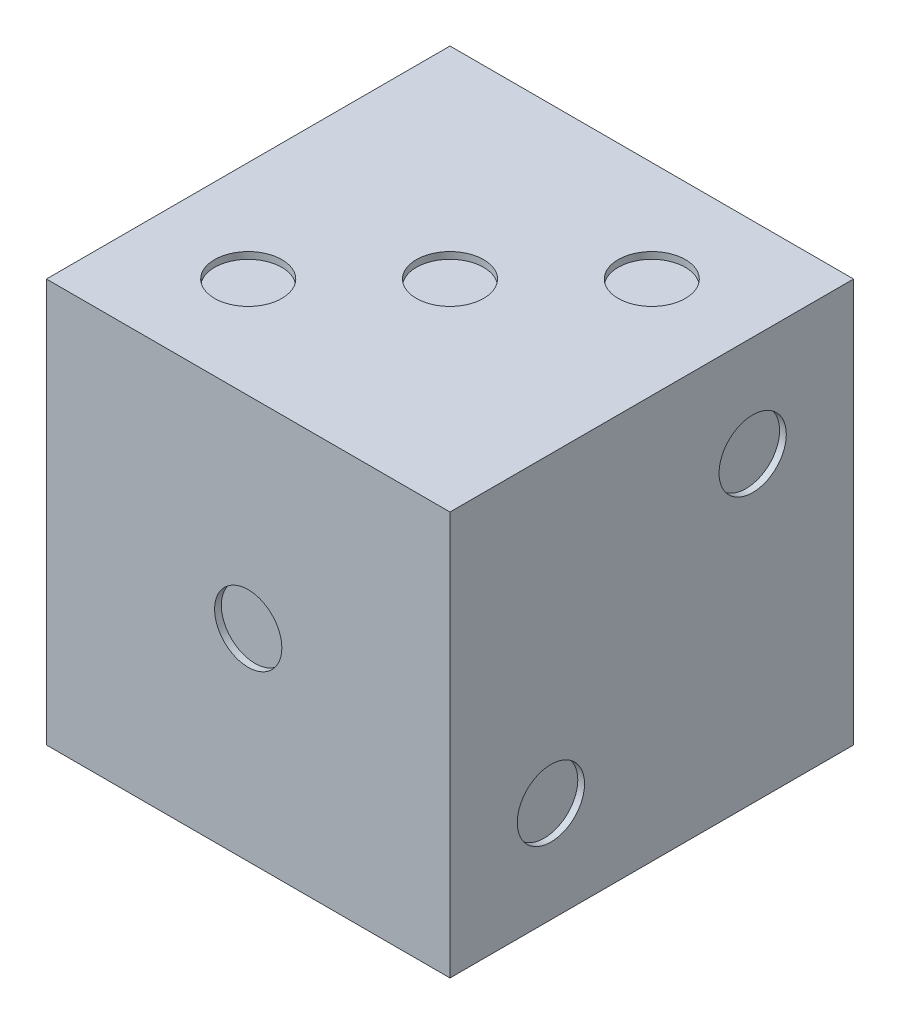
ISO-10303-21;
HEADER;
FILE_DESCRIPTION(('STEP AP214'),'2;1');
FILE_NAME('part.step','',(''),(''),'','','');
FILE_SCHEMA(('AUTOMOTIVE_DESIGN { 1 0 10303 214 1 1 1 1 }'));
ENDSEC;
DATA;
#1=APPLICATION_CONTEXT('core data for automotive mechanical design processes');
#2=APPLICATION_PROTOCOL_DEFINITION('international standard','automotive_design',2000,#1);
#3=PRODUCT_CONTEXT('',#1,'mechanical');
#4=PRODUCT('Part','Part','',(#3));
#5=PRODUCT_RELATED_PRODUCT_CATEGORY('part','',(#4));
#6=PRODUCT_DEFINITION_FORMATION('','',#4);
#7=PRODUCT_DEFINITION_CONTEXT('part definition',#1,'design');
#8=PRODUCT_DEFINITION('design','',#6,#7);
#9=PRODUCT_DEFINITION_SHAPE('','',#8);
#10=(LENGTH_UNIT() NAMED_UNIT(*) SI_UNIT(.MILLI.,.METRE.));
#11=(NAMED_UNIT(*) PLANE_ANGLE_UNIT() SI_UNIT($,.RADIAN.));
#12=(NAMED_UNIT(*) SI_UNIT($,.STERADIAN.) SOLID_ANGLE_UNIT());
#13=UNCERTAINTY_MEASURE_WITH_UNIT(LENGTH_MEASURE(1.E-05),#10,'distance_accuracy_value','');
#14=(GEOMETRIC_REPRESENTATION_CONTEXT(3) GLOBAL_UNCERTAINTY_ASSIGNED_CONTEXT((#13)) GLOBAL_UNIT_ASSIGNED_CONTEXT((#10,
#11,#12)) REPRESENTATION_CONTEXT('',''));
#15=CARTESIAN_POINT('',(0.,0.,0.));
#16=DIRECTION('',(0.,0.,1.));
#17=DIRECTION('',(1.,0.,0.));
#18=AXIS2_PLACEMENT_3D('',#15,#16,#17);
#19=CARTESIAN_POINT('',(0.,60.,0.));
#20=DIRECTION('',(1.,0.,0.));
#21=DIRECTION('',(0.,0.,-1.));
#22=AXIS2_PLACEMENT_3D('',#19,#20,#21);
#23=PLANE('',#22);
#24=CARTESIAN_POINT('',(0.,15.,-15.));
#25=DIRECTION('',(-1.,0.,0.));
#26=DIRECTION('',(0.,0.,1.));
#27=AXIS2_PLACEMENT_3D('',#24,#25,#26);
#28=CIRCLE('',#27,5.);
#29=CARTESIAN_POINT('',(0.,15.,-9.99999999999999));
#30=VERTEX_POINT('',#29);
#31=EDGE_CURVE('E133',#30,#30,#28,.T.);
#32=ORIENTED_EDGE('',*,*,#31,.F.);
#33=EDGE_LOOP('',(#32));
#34=FACE_BOUND('',#33,.T.);
#35=CARTESIAN_POINT('',(0.,15.,-45.));
#36=DIRECTION('',(-1.,0.,0.));
#37=DIRECTION('',(0.,0.,1.));
#38=AXIS2_PLACEMENT_3D('',#35,#36,#37);
#39=CIRCLE('',#38,5.);
#40=CARTESIAN_POINT('',(0.,15.,-40.));
#41=VERTEX_POINT('',#40);
#42=EDGE_CURVE('E137',#41,#41,#39,.T.);
#43=ORIENTED_EDGE('',*,*,#42,.F.);
#44=EDGE_LOOP('',(#43));
#45=FACE_BOUND('',#44,.T.);
#46=CARTESIAN_POINT('',(0.,45.,-15.));
#47=DIRECTION('',(-1.,0.,0.));
#48=DIRECTION('',(0.,0.,1.));
#49=AXIS2_PLACEMENT_3D('',#46,#47,#48);
#50=CIRCLE('',#49,5.);
#51=CARTESIAN_POINT('',(0.,45.,-9.99999999999998));
#52=VERTEX_POINT('',#51);
#53=EDGE_CURVE('E141',#52,#52,#50,.T.);
#54=ORIENTED_EDGE('',*,*,#53,.F.);
#55=EDGE_LOOP('',(#54));
#56=FACE_BOUND('',#55,.T.);
#57=CARTESIAN_POINT('',(0.,45.,-45.));
#58=DIRECTION('',(-1.,0.,0.));
#59=DIRECTION('',(0.,0.,1.));
#60=AXIS2_PLACEMENT_3D('',#57,#58,#59);
#61=CIRCLE('',#60,5.);
#62=CARTESIAN_POINT('',(0.,45.,-40.));
#63=VERTEX_POINT('',#62);
#64=EDGE_CURVE('E145',#63,#63,#61,.T.);
#65=ORIENTED_EDGE('',*,*,#64,.F.);
#66=EDGE_LOOP('',(#65));
#67=FACE_BOUND('',#66,.T.);
#68=CARTESIAN_POINT('',(0.,30.,-30.));
#69=DIRECTION('',(-1.,0.,0.));
#70=DIRECTION('',(0.,0.,1.));
#71=AXIS2_PLACEMENT_3D('',#68,#69,#70);
#72=CIRCLE('',#71,5.);
#73=CARTESIAN_POINT('',(0.,30.,-25.));
#74=VERTEX_POINT('',#73);
#75=EDGE_CURVE('E148',#74,#74,#72,.T.);
#76=ORIENTED_EDGE('',*,*,#75,.F.);
#77=EDGE_LOOP('',(#76));
#78=FACE_BOUND('',#77,.T.);
#79=DIRECTION('',(0.,0.,1.));
#80=VECTOR('',#79,1.);
#81=CARTESIAN_POINT('',(0.,0.,0.));
#82=LINE('',#81,#80);
#83=CARTESIAN_POINT('',(0.,0.,-60.));
#84=VERTEX_POINT('',#83);
#85=CARTESIAN_POINT('',(0.,0.,0.));
#86=VERTEX_POINT('',#85);
#87=EDGE_CURVE('E74',#84,#86,#82,.T.);
#88=ORIENTED_EDGE('',*,*,#87,.T.);
#89=DIRECTION('',(0.,-1.,0.));
#90=VECTOR('',#89,1.);
#91=CARTESIAN_POINT('',(0.,60.,0.));
#92=LINE('',#91,#90);
#93=CARTESIAN_POINT('',(0.,60.,0.));
#94=VERTEX_POINT('',#93);
#95=EDGE_CURVE('E11',#94,#86,#92,.T.);
#96=ORIENTED_EDGE('',*,*,#95,.F.);
#97=DIRECTION('',(0.,0.,1.));
#98=VECTOR('',#97,1.);
#99=CARTESIAN_POINT('',(0.,60.,0.));
#100=LINE('',#99,#98);
#101=CARTESIAN_POINT('',(0.,60.,-60.));
#102=VERTEX_POINT('',#101);
#103=EDGE_CURVE('E97',#102,#94,#100,.T.);
#104=ORIENTED_EDGE('',*,*,#103,.F.);
#105=DIRECTION('',(0.,-1.,0.));
#106=VECTOR('',#105,1.);
#107=CARTESIAN_POINT('',(0.,60.,-60.));
#108=LINE('',#107,#106);
#109=EDGE_CURVE('E86',#102,#84,#108,.T.);
#110=ORIENTED_EDGE('',*,*,#109,.T.);
#111=EDGE_LOOP('',(#88,#96,#104,#110));
#112=FACE_BOUND('',#111,.T.);
#113=ADVANCED_FACE('F30',(#34,#45,#56,#67,#78,#112),#23,.F.);
#114=CARTESIAN_POINT('',(0.,60.,0.));
#115=DIRECTION('',(0.,0.,-1.));
#116=DIRECTION('',(-1.,0.,0.));
#117=AXIS2_PLACEMENT_3D('',#114,#115,#116);
#118=PLANE('',#117);
#119=CARTESIAN_POINT('',(30.,30.,0.));
#120=DIRECTION('',(0.,0.,1.));
#121=DIRECTION('',(1.,0.,0.));
#122=AXIS2_PLACEMENT_3D('',#119,#120,#121);
#123=CIRCLE('',#122,5.);
#124=CARTESIAN_POINT('',(35.,30.,0.));
#125=VERTEX_POINT('',#124);
#126=EDGE_CURVE('E195',#125,#125,#123,.T.);
#127=ORIENTED_EDGE('',*,*,#126,.F.);
#128=EDGE_LOOP('',(#127));
#129=FACE_BOUND('',#128,.T.);
#130=DIRECTION('',(1.,0.,0.));
#131=VECTOR('',#130,1.);
#132=CARTESIAN_POINT('',(0.,0.,0.));
#133=LINE('',#132,#131);
#134=CARTESIAN_POINT('',(60.,0.,0.));
#135=VERTEX_POINT('',#134);
#136=EDGE_CURVE('E70',#86,#135,#133,.T.);
#137=ORIENTED_EDGE('',*,*,#136,.T.);
#138=DIRECTION('',(0.,-1.,0.));
#139=VECTOR('',#138,1.);
#140=CARTESIAN_POINT('',(60.,60.,0.));
#141=LINE('',#140,#139);
#142=CARTESIAN_POINT('',(60.,60.,0.));
#143=VERTEX_POINT('',#142);
#144=EDGE_CURVE('E37',#143,#135,#141,.T.);
#145=ORIENTED_EDGE('',*,*,#144,.F.);
#146=DIRECTION('',(1.,0.,0.));
#147=VECTOR('',#146,1.);
#148=CARTESIAN_POINT('',(0.,60.,0.));
#149=LINE('',#148,#147);
#150=EDGE_CURVE('E82',#94,#143,#149,.T.);
#151=ORIENTED_EDGE('',*,*,#150,.F.);
#152=ORIENTED_EDGE('',*,*,#95,.T.);
#153=EDGE_LOOP('',(#137,#145,#151,#152));
#154=FACE_BOUND('',#153,.T.);
#155=ADVANCED_FACE('F81',(#129,#154),#118,.F.);
#156=CARTESIAN_POINT('',(60.,60.,0.));
#157=DIRECTION('',(-1.,0.,0.));
#158=DIRECTION('',(0.,0.,1.));
#159=AXIS2_PLACEMENT_3D('',#156,#157,#158);
#160=PLANE('',#159);
#161=CARTESIAN_POINT('',(60.,15.,-15.));
#162=DIRECTION('',(1.,0.,0.));
#163=DIRECTION('',(0.,0.,-1.));
#164=AXIS2_PLACEMENT_3D('',#161,#162,#163);
#165=CIRCLE('',#164,5.);
#166=CARTESIAN_POINT('',(60.,15.,-20.));
#167=VERTEX_POINT('',#166);
#168=EDGE_CURVE('E201',#167,#167,#165,.T.);
#169=ORIENTED_EDGE('',*,*,#168,.F.);
#170=EDGE_LOOP('',(#169));
#171=FACE_BOUND('',#170,.T.);
#172=CARTESIAN_POINT('',(60.,45.,-45.));
#173=DIRECTION('',(1.,0.,0.));
#174=DIRECTION('',(0.,0.,-1.));
#175=AXIS2_PLACEMENT_3D('',#172,#173,#174);
#176=CIRCLE('',#175,5.);
#177=CARTESIAN_POINT('',(60.,45.,-50.));
#178=VERTEX_POINT('',#177);
#179=EDGE_CURVE('E207',#178,#178,#176,.T.);
#180=ORIENTED_EDGE('',*,*,#179,.F.);
#181=EDGE_LOOP('',(#180));
#182=FACE_BOUND('',#181,.T.);
#183=DIRECTION('',(0.,0.,-1.));
#184=VECTOR('',#183,1.);
#185=CARTESIAN_POINT('',(60.,0.,0.));
#186=LINE('',#185,#184);
#187=CARTESIAN_POINT('',(60.,0.,-60.));
#188=VERTEX_POINT('',#187);
#189=EDGE_CURVE('E75',#135,#188,#186,.T.);
#190=ORIENTED_EDGE('',*,*,#189,.T.);
#191=DIRECTION('',(0.,-1.,0.));
#192=VECTOR('',#191,1.);
#193=CARTESIAN_POINT('',(60.,60.,-60.));
#194=LINE('',#193,#192);
#195=CARTESIAN_POINT('',(60.,60.,-60.));
#196=VERTEX_POINT('',#195);
#197=EDGE_CURVE('E103',#196,#188,#194,.T.);
#198=ORIENTED_EDGE('',*,*,#197,.F.);
#199=DIRECTION('',(0.,0.,-1.));
#200=VECTOR('',#199,1.);
#201=CARTESIAN_POINT('',(60.,60.,0.));
#202=LINE('',#201,#200);
#203=EDGE_CURVE('E49',#143,#196,#202,.T.);
#204=ORIENTED_EDGE('',*,*,#203,.F.);
#205=ORIENTED_EDGE('',*,*,#144,.T.);
#206=EDGE_LOOP('',(#190,#198,#204,#205));
#207=FACE_BOUND('',#206,.T.);
#208=ADVANCED_FACE('F106',(#171,#182,#207),#160,.F.);
#209=CARTESIAN_POINT('',(0.,60.,-60.));
#210=DIRECTION('',(0.,0.,1.));
#211=DIRECTION('',(1.,0.,0.));
#212=AXIS2_PLACEMENT_3D('',#209,#210,#211);
#213=PLANE('',#212);
#214=CARTESIAN_POINT('',(45.,15.,-60.));
#215=DIRECTION('',(0.,0.,-1.));
#216=DIRECTION('',(-1.,0.,0.));
#217=AXIS2_PLACEMENT_3D('',#214,#215,#216);
#218=CIRCLE('',#217,5.);
#219=CARTESIAN_POINT('',(40.,15.,-60.));
#220=VERTEX_POINT('',#219);
#221=EDGE_CURVE('E154',#220,#220,#218,.T.);
#222=ORIENTED_EDGE('',*,*,#221,.F.);
#223=EDGE_LOOP('',(#222));
#224=FACE_BOUND('',#223,.T.);
#225=CARTESIAN_POINT('',(45.,30.,-60.));
#226=DIRECTION('',(0.,0.,-1.));
#227=DIRECTION('',(-1.,0.,0.));
#228=AXIS2_PLACEMENT_3D('',#225,#226,#227);
#229=CIRCLE('',#228,5.);
#230=CARTESIAN_POINT('',(40.,30.,-60.));
#231=VERTEX_POINT('',#230);
#232=EDGE_CURVE('E165',#231,#231,#229,.T.);
#233=ORIENTED_EDGE('',*,*,#232,.F.);
#234=EDGE_LOOP('',(#233));
#235=FACE_BOUND('',#234,.T.);
#236=CARTESIAN_POINT('',(45.,45.,-60.));
#237=DIRECTION('',(0.,0.,-1.));
#238=DIRECTION('',(-1.,0.,0.));
#239=AXIS2_PLACEMENT_3D('',#236,#237,#238);
#240=CIRCLE('',#239,5.);
#241=CARTESIAN_POINT('',(40.,45.,-60.));
#242=VERTEX_POINT('',#241);
#243=EDGE_CURVE('E171',#242,#242,#240,.T.);
#244=ORIENTED_EDGE('',*,*,#243,.F.);
#245=EDGE_LOOP('',(#244));
#246=FACE_BOUND('',#245,.T.);
#247=CARTESIAN_POINT('',(15.,15.,-60.));
#248=DIRECTION('',(0.,0.,-1.));
#249=DIRECTION('',(-1.,0.,0.));
#250=AXIS2_PLACEMENT_3D('',#247,#248,#249);
#251=CIRCLE('',#250,5.);
#252=CARTESIAN_POINT('',(10.,15.,-60.));
#253=VERTEX_POINT('',#252);
#254=EDGE_CURVE('E177',#253,#253,#251,.T.);
#255=ORIENTED_EDGE('',*,*,#254,.F.);
#256=EDGE_LOOP('',(#255));
#257=FACE_BOUND('',#256,.T.);
#258=CARTESIAN_POINT('',(15.,30.,-60.));
#259=DIRECTION('',(0.,0.,-1.));
#260=DIRECTION('',(-1.,0.,0.));
#261=AXIS2_PLACEMENT_3D('',#258,#259,#260);
#262=CIRCLE('',#261,5.);
#263=CARTESIAN_POINT('',(10.,30.,-60.));
#264=VERTEX_POINT('',#263);
#265=EDGE_CURVE('E183',#264,#264,#262,.T.);
#266=ORIENTED_EDGE('',*,*,#265,.F.);
#267=EDGE_LOOP('',(#266));
#268=FACE_BOUND('',#267,.T.);
#269=CARTESIAN_POINT('',(15.,45.,-60.));
#270=DIRECTION('',(0.,0.,-1.));
#271=DIRECTION('',(-1.,0.,0.));
#272=AXIS2_PLACEMENT_3D('',#269,#270,#271);
#273=CIRCLE('',#272,5.);
#274=CARTESIAN_POINT('',(10.,45.,-60.));
#275=VERTEX_POINT('',#274);
#276=EDGE_CURVE('E189',#275,#275,#273,.T.);
#277=ORIENTED_EDGE('',*,*,#276,.F.);
#278=EDGE_LOOP('',(#277));
#279=FACE_BOUND('',#278,.T.);
#280=DIRECTION('',(-1.,0.,0.));
#281=VECTOR('',#280,1.);
#282=CARTESIAN_POINT('',(0.,0.,-60.));
#283=LINE('',#282,#281);
#284=EDGE_CURVE('E95',#188,#84,#283,.T.);
#285=ORIENTED_EDGE('',*,*,#284,.T.);
#286=ORIENTED_EDGE('',*,*,#109,.F.);
#287=DIRECTION('',(-1.,0.,0.));
#288=VECTOR('',#287,1.);
#289=CARTESIAN_POINT('',(0.,60.,-60.));
#290=LINE('',#289,#288);
#291=EDGE_CURVE('E44',#196,#102,#290,.T.);
#292=ORIENTED_EDGE('',*,*,#291,.F.);
#293=ORIENTED_EDGE('',*,*,#197,.T.);
#294=EDGE_LOOP('',(#285,#286,#292,#293));
#295=FACE_BOUND('',#294,.T.);
#296=ADVANCED_FACE('F108',(#224,#235,#246,#257,#268,#279,#295),#213,.F.);
#297=CARTESIAN_POINT('',(0.,60.,-60.));
#298=DIRECTION('',(0.,-1.,0.));
#299=DIRECTION('',(0.,0.,-1.));
#300=AXIS2_PLACEMENT_3D('',#297,#298,#299);
#301=PLANE('',#300);
#302=CARTESIAN_POINT('',(15.,60.,-15.));
#303=DIRECTION('',(0.,1.,0.));
#304=DIRECTION('',(0.,0.,1.));
#305=AXIS2_PLACEMENT_3D('',#302,#303,#304);
#306=CIRCLE('',#305,5.);
#307=CARTESIAN_POINT('',(15.,60.,-9.99999999999999));
#308=VERTEX_POINT('',#307);
#309=EDGE_CURVE('E213',#308,#308,#306,.T.);
#310=ORIENTED_EDGE('',*,*,#309,.F.);
#311=EDGE_LOOP('',(#310));
#312=FACE_BOUND('',#311,.T.);
#313=CARTESIAN_POINT('',(30.,60.,-30.));
#314=DIRECTION('',(0.,1.,0.));
#315=DIRECTION('',(0.,0.,1.));
#316=AXIS2_PLACEMENT_3D('',#313,#314,#315);
#317=CIRCLE('',#316,5.);
#318=CARTESIAN_POINT('',(30.,60.,-25.));
#319=VERTEX_POINT('',#318);
#320=EDGE_CURVE('E219',#319,#319,#317,.T.);
#321=ORIENTED_EDGE('',*,*,#320,.F.);
#322=EDGE_LOOP('',(#321));
#323=FACE_BOUND('',#322,.T.);
#324=CARTESIAN_POINT('',(45.,60.,-45.));
#325=DIRECTION('',(0.,1.,0.));
#326=DIRECTION('',(0.,0.,1.));
#327=AXIS2_PLACEMENT_3D('',#324,#325,#326);
#328=CIRCLE('',#327,5.);
#329=CARTESIAN_POINT('',(45.,60.,-40.));
#330=VERTEX_POINT('',#329);
#331=EDGE_CURVE('E90',#330,#330,#328,.T.);
#332=ORIENTED_EDGE('',*,*,#331,.F.);
#333=EDGE_LOOP('',(#332));
#334=FACE_BOUND('',#333,.T.);
#335=ORIENTED_EDGE('',*,*,#103,.T.);
#336=ORIENTED_EDGE('',*,*,#150,.T.);
#337=ORIENTED_EDGE('',*,*,#203,.T.);
#338=ORIENTED_EDGE('',*,*,#291,.T.);
#339=EDGE_LOOP('',(#335,#336,#337,#338));
#340=FACE_BOUND('',#339,.T.);
#341=ADVANCED_FACE('F109',(#312,#323,#334,#340),#301,.F.);
#342=CARTESIAN_POINT('',(0.,0.,-60.));
#343=DIRECTION('',(0.,-1.,0.));
#344=DIRECTION('',(0.,0.,-1.));
#345=AXIS2_PLACEMENT_3D('',#342,#343,#344);
#346=PLANE('',#345);
#347=CARTESIAN_POINT('',(45.,0.,-15.));
#348=DIRECTION('',(0.,-1.,0.));
#349=DIRECTION('',(0.,0.,-1.));
#350=AXIS2_PLACEMENT_3D('',#347,#348,#349);
#351=CIRCLE('',#350,5.);
#352=CARTESIAN_POINT('',(45.,0.,-20.));
#353=VERTEX_POINT('',#352);
#354=EDGE_CURVE('E404',#353,#353,#351,.T.);
#355=ORIENTED_EDGE('',*,*,#354,.F.);
#356=EDGE_LOOP('',(#355));
#357=FACE_BOUND('',#356,.T.);
#358=CARTESIAN_POINT('',(45.,0.,-45.));
#359=DIRECTION('',(0.,-1.,0.));
#360=DIRECTION('',(0.,0.,-1.));
#361=AXIS2_PLACEMENT_3D('',#358,#359,#360);
#362=CIRCLE('',#361,5.);
#363=CARTESIAN_POINT('',(45.,0.,-50.));
#364=VERTEX_POINT('',#363);
#365=EDGE_CURVE('E403',#364,#364,#362,.T.);
#366=ORIENTED_EDGE('',*,*,#365,.F.);
#367=EDGE_LOOP('',(#366));
#368=FACE_BOUND('',#367,.T.);
#369=CARTESIAN_POINT('',(15.,0.,-15.));
#370=DIRECTION('',(0.,-1.,0.));
#371=DIRECTION('',(0.,0.,-1.));
#372=AXIS2_PLACEMENT_3D('',#369,#370,#371);
#373=CIRCLE('',#372,5.);
#374=CARTESIAN_POINT('',(15.,0.,-20.));
#375=VERTEX_POINT('',#374);
#376=EDGE_CURVE('E414',#375,#375,#373,.T.);
#377=ORIENTED_EDGE('',*,*,#376,.F.);
#378=EDGE_LOOP('',(#377));
#379=FACE_BOUND('',#378,.T.);
#380=CARTESIAN_POINT('',(15.,0.,-45.));
#381=DIRECTION('',(0.,-1.,0.));
#382=DIRECTION('',(0.,0.,-1.));
#383=AXIS2_PLACEMENT_3D('',#380,#381,#382);
#384=CIRCLE('',#383,5.);
#385=CARTESIAN_POINT('',(15.,0.,-50.));
#386=VERTEX_POINT('',#385);
#387=EDGE_CURVE('E420',#386,#386,#384,.T.);
#388=ORIENTED_EDGE('',*,*,#387,.F.);
#389=EDGE_LOOP('',(#388));
#390=FACE_BOUND('',#389,.T.);
#391=ORIENTED_EDGE('',*,*,#87,.F.);
#392=ORIENTED_EDGE('',*,*,#284,.F.);
#393=ORIENTED_EDGE('',*,*,#189,.F.);
#394=ORIENTED_EDGE('',*,*,#136,.F.);
#395=EDGE_LOOP('',(#391,#392,#393,#394));
#396=FACE_BOUND('',#395,.T.);
#397=ADVANCED_FACE('F71',(#357,#368,#379,#390,#396),#346,.T.);
#398=CARTESIAN_POINT('',(45.,59.,-45.));
#399=DIRECTION('',(0.,1.,0.));
#400=DIRECTION('',(0.,0.,1.));
#401=AXIS2_PLACEMENT_3D('',#398,#399,#400);
#402=CYLINDRICAL_SURFACE('',#401,5.);
#403=CARTESIAN_POINT('',(45.,59.,-45.));
#404=DIRECTION('',(0.,1.,0.));
#405=DIRECTION('',(0.,0.,1.));
#406=AXIS2_PLACEMENT_3D('',#403,#404,#405);
#407=CIRCLE('',#406,5.);
#408=CARTESIAN_POINT('',(45.,59.,-40.));
#409=VERTEX_POINT('',#408);
#410=EDGE_CURVE('E87',#409,#409,#407,.T.);
#411=ORIENTED_EDGE('',*,*,#410,.F.);
#412=EDGE_LOOP('',(#411));
#413=FACE_BOUND('',#412,.T.);
#414=ORIENTED_EDGE('',*,*,#331,.T.);
#415=EDGE_LOOP('',(#414));
#416=FACE_BOUND('',#415,.T.);
#417=ADVANCED_FACE('F117',(#413,#416),#402,.F.);
#418=CARTESIAN_POINT('',(45.,59.,-45.));
#419=DIRECTION('',(0.,1.,0.));
#420=DIRECTION('',(0.,0.,1.));
#421=AXIS2_PLACEMENT_3D('',#418,#419,#420);
#422=PLANE('',#421);
#423=ORIENTED_EDGE('',*,*,#410,.T.);
#424=EDGE_LOOP('',(#423));
#425=FACE_BOUND('',#424,.T.);
#426=ADVANCED_FACE('F229',(#425),#422,.T.);
#427=CARTESIAN_POINT('',(30.,59.,-30.));
#428=DIRECTION('',(0.,1.,0.));
#429=DIRECTION('',(0.,0.,1.));
#430=AXIS2_PLACEMENT_3D('',#427,#428,#429);
#431=CYLINDRICAL_SURFACE('',#430,5.);
#432=CARTESIAN_POINT('',(30.,59.,-30.));
#433=DIRECTION('',(0.,1.,0.));
#434=DIRECTION('',(0.,0.,1.));
#435=AXIS2_PLACEMENT_3D('',#432,#433,#434);
#436=CIRCLE('',#435,5.);
#437=CARTESIAN_POINT('',(30.,59.,-25.));
#438=VERTEX_POINT('',#437);
#439=EDGE_CURVE('E222',#438,#438,#436,.T.);
#440=ORIENTED_EDGE('',*,*,#439,.F.);
#441=EDGE_LOOP('',(#440));
#442=FACE_BOUND('',#441,.T.);
#443=ORIENTED_EDGE('',*,*,#320,.T.);
#444=EDGE_LOOP('',(#443));
#445=FACE_BOUND('',#444,.T.);
#446=ADVANCED_FACE('F235',(#442,#445),#431,.F.);
#447=CARTESIAN_POINT('',(30.,59.,-30.));
#448=DIRECTION('',(0.,1.,0.));
#449=DIRECTION('',(0.,0.,1.));
#450=AXIS2_PLACEMENT_3D('',#447,#448,#449);
#451=PLANE('',#450);
#452=ORIENTED_EDGE('',*,*,#439,.T.);
#453=EDGE_LOOP('',(#452));
#454=FACE_BOUND('',#453,.T.);
#455=ADVANCED_FACE('F242',(#454),#451,.T.);
#456=CARTESIAN_POINT('',(15.,59.,-15.));
#457=DIRECTION('',(0.,1.,0.));
#458=DIRECTION('',(0.,0.,1.));
#459=AXIS2_PLACEMENT_3D('',#456,#457,#458);
#460=CYLINDRICAL_SURFACE('',#459,5.);
#461=CARTESIAN_POINT('',(15.,59.,-15.));
#462=DIRECTION('',(0.,1.,0.));
#463=DIRECTION('',(0.,0.,1.));
#464=AXIS2_PLACEMENT_3D('',#461,#462,#463);
#465=CIRCLE('',#464,5.);
#466=CARTESIAN_POINT('',(15.,59.,-9.99999999999999));
#467=VERTEX_POINT('',#466);
#468=EDGE_CURVE('E216',#467,#467,#465,.T.);
#469=ORIENTED_EDGE('',*,*,#468,.F.);
#470=EDGE_LOOP('',(#469));
#471=FACE_BOUND('',#470,.T.);
#472=ORIENTED_EDGE('',*,*,#309,.T.);
#473=EDGE_LOOP('',(#472));
#474=FACE_BOUND('',#473,.T.);
#475=ADVANCED_FACE('F246',(#471,#474),#460,.F.);
#476=CARTESIAN_POINT('',(15.,59.,-15.));
#477=DIRECTION('',(0.,1.,0.));
#478=DIRECTION('',(0.,0.,1.));
#479=AXIS2_PLACEMENT_3D('',#476,#477,#478);
#480=PLANE('',#479);
#481=ORIENTED_EDGE('',*,*,#468,.T.);
#482=EDGE_LOOP('',(#481));
#483=FACE_BOUND('',#482,.T.);
#484=ADVANCED_FACE('F250',(#483),#480,.T.);
#485=CARTESIAN_POINT('',(59.,45.,-45.));
#486=DIRECTION('',(1.,0.,0.));
#487=DIRECTION('',(0.,0.,-1.));
#488=AXIS2_PLACEMENT_3D('',#485,#486,#487);
#489=CYLINDRICAL_SURFACE('',#488,5.);
#490=CARTESIAN_POINT('',(59.,45.,-45.));
#491=DIRECTION('',(1.,0.,0.));
#492=DIRECTION('',(0.,0.,-1.));
#493=AXIS2_PLACEMENT_3D('',#490,#491,#492);
#494=CIRCLE('',#493,5.);
#495=CARTESIAN_POINT('',(59.,45.,-50.));
#496=VERTEX_POINT('',#495);
#497=EDGE_CURVE('E210',#496,#496,#494,.T.);
#498=ORIENTED_EDGE('',*,*,#497,.F.);
#499=EDGE_LOOP('',(#498));
#500=FACE_BOUND('',#499,.T.);
#501=ORIENTED_EDGE('',*,*,#179,.T.);
#502=EDGE_LOOP('',(#501));
#503=FACE_BOUND('',#502,.T.);
#504=ADVANCED_FACE('F254',(#500,#503),#489,.F.);
#505=CARTESIAN_POINT('',(59.,45.,-45.));
#506=DIRECTION('',(1.,0.,0.));
#507=DIRECTION('',(0.,0.,-1.));
#508=AXIS2_PLACEMENT_3D('',#505,#506,#507);
#509=PLANE('',#508);
#510=ORIENTED_EDGE('',*,*,#497,.T.);
#511=EDGE_LOOP('',(#510));
#512=FACE_BOUND('',#511,.T.);
#513=ADVANCED_FACE('F258',(#512),#509,.T.);
#514=CARTESIAN_POINT('',(59.,15.,-15.));
#515=DIRECTION('',(1.,0.,0.));
#516=DIRECTION('',(0.,0.,-1.));
#517=AXIS2_PLACEMENT_3D('',#514,#515,#516);
#518=CYLINDRICAL_SURFACE('',#517,5.);
#519=CARTESIAN_POINT('',(59.,15.,-15.));
#520=DIRECTION('',(1.,0.,0.));
#521=DIRECTION('',(0.,0.,-1.));
#522=AXIS2_PLACEMENT_3D('',#519,#520,#521);
#523=CIRCLE('',#522,5.);
#524=CARTESIAN_POINT('',(59.,15.,-20.));
#525=VERTEX_POINT('',#524);
#526=EDGE_CURVE('E204',#525,#525,#523,.T.);
#527=ORIENTED_EDGE('',*,*,#526,.F.);
#528=EDGE_LOOP('',(#527));
#529=FACE_BOUND('',#528,.T.);
#530=ORIENTED_EDGE('',*,*,#168,.T.);
#531=EDGE_LOOP('',(#530));
#532=FACE_BOUND('',#531,.T.);
#533=ADVANCED_FACE('F262',(#529,#532),#518,.F.);
#534=CARTESIAN_POINT('',(59.,15.,-15.));
#535=DIRECTION('',(1.,0.,0.));
#536=DIRECTION('',(0.,0.,-1.));
#537=AXIS2_PLACEMENT_3D('',#534,#535,#536);
#538=PLANE('',#537);
#539=ORIENTED_EDGE('',*,*,#526,.T.);
#540=EDGE_LOOP('',(#539));
#541=FACE_BOUND('',#540,.T.);
#542=ADVANCED_FACE('F266',(#541),#538,.T.);
#543=CARTESIAN_POINT('',(30.,30.,-1.));
#544=DIRECTION('',(0.,0.,1.));
#545=DIRECTION('',(1.,0.,0.));
#546=AXIS2_PLACEMENT_3D('',#543,#544,#545);
#547=CYLINDRICAL_SURFACE('',#546,5.);
#548=CARTESIAN_POINT('',(30.,30.,-1.));
#549=DIRECTION('',(0.,0.,1.));
#550=DIRECTION('',(1.,0.,0.));
#551=AXIS2_PLACEMENT_3D('',#548,#549,#550);
#552=CIRCLE('',#551,5.);
#553=CARTESIAN_POINT('',(35.,30.,-1.));
#554=VERTEX_POINT('',#553);
#555=EDGE_CURVE('E198',#554,#554,#552,.T.);
#556=ORIENTED_EDGE('',*,*,#555,.F.);
#557=EDGE_LOOP('',(#556));
#558=FACE_BOUND('',#557,.T.);
#559=ORIENTED_EDGE('',*,*,#126,.T.);
#560=EDGE_LOOP('',(#559));
#561=FACE_BOUND('',#560,.T.);
#562=ADVANCED_FACE('F270',(#558,#561),#547,.F.);
#563=CARTESIAN_POINT('',(30.,30.,-1.));
#564=DIRECTION('',(0.,0.,1.));
#565=DIRECTION('',(1.,0.,0.));
#566=AXIS2_PLACEMENT_3D('',#563,#564,#565);
#567=PLANE('',#566);
#568=ORIENTED_EDGE('',*,*,#555,.T.);
#569=EDGE_LOOP('',(#568));
#570=FACE_BOUND('',#569,.T.);
#571=ADVANCED_FACE('F274',(#570),#567,.T.);
#572=CARTESIAN_POINT('',(15.,45.,-59.));
#573=DIRECTION('',(0.,0.,-1.));
#574=DIRECTION('',(-1.,0.,0.));
#575=AXIS2_PLACEMENT_3D('',#572,#573,#574);
#576=CYLINDRICAL_SURFACE('',#575,5.);
#577=CARTESIAN_POINT('',(15.,45.,-59.));
#578=DIRECTION('',(0.,0.,-1.));
#579=DIRECTION('',(-1.,0.,0.));
#580=AXIS2_PLACEMENT_3D('',#577,#578,#579);
#581=CIRCLE('',#580,5.);
#582=CARTESIAN_POINT('',(10.,45.,-59.));
#583=VERTEX_POINT('',#582);
#584=EDGE_CURVE('E192',#583,#583,#581,.T.);
#585=ORIENTED_EDGE('',*,*,#584,.F.);
#586=EDGE_LOOP('',(#585));
#587=FACE_BOUND('',#586,.T.);
#588=ORIENTED_EDGE('',*,*,#276,.T.);
#589=EDGE_LOOP('',(#588));
#590=FACE_BOUND('',#589,.T.);
#591=ADVANCED_FACE('F278',(#587,#590),#576,.F.);
#592=CARTESIAN_POINT('',(15.,45.,-59.));
#593=DIRECTION('',(0.,0.,-1.));
#594=DIRECTION('',(-1.,0.,0.));
#595=AXIS2_PLACEMENT_3D('',#592,#593,#594);
#596=PLANE('',#595);
#597=ORIENTED_EDGE('',*,*,#584,.T.);
#598=EDGE_LOOP('',(#597));
#599=FACE_BOUND('',#598,.T.);
#600=ADVANCED_FACE('F282',(#599),#596,.T.);
#601=CARTESIAN_POINT('',(15.,30.,-59.));
#602=DIRECTION('',(0.,0.,-1.));
#603=DIRECTION('',(-1.,0.,0.));
#604=AXIS2_PLACEMENT_3D('',#601,#602,#603);
#605=CYLINDRICAL_SURFACE('',#604,5.);
#606=CARTESIAN_POINT('',(15.,30.,-59.));
#607=DIRECTION('',(0.,0.,-1.));
#608=DIRECTION('',(-1.,0.,0.));
#609=AXIS2_PLACEMENT_3D('',#606,#607,#608);
#610=CIRCLE('',#609,5.);
#611=CARTESIAN_POINT('',(10.,30.,-59.));
#612=VERTEX_POINT('',#611);
#613=EDGE_CURVE('E186',#612,#612,#610,.T.);
#614=ORIENTED_EDGE('',*,*,#613,.F.);
#615=EDGE_LOOP('',(#614));
#616=FACE_BOUND('',#615,.T.);
#617=ORIENTED_EDGE('',*,*,#265,.T.);
#618=EDGE_LOOP('',(#617));
#619=FACE_BOUND('',#618,.T.);
#620=ADVANCED_FACE('F286',(#616,#619),#605,.F.);
#621=CARTESIAN_POINT('',(15.,30.,-59.));
#622=DIRECTION('',(0.,0.,-1.));
#623=DIRECTION('',(-1.,0.,0.));
#624=AXIS2_PLACEMENT_3D('',#621,#622,#623);
#625=PLANE('',#624);
#626=ORIENTED_EDGE('',*,*,#613,.T.);
#627=EDGE_LOOP('',(#626));
#628=FACE_BOUND('',#627,.T.);
#629=ADVANCED_FACE('F290',(#628),#625,.T.);
#630=CARTESIAN_POINT('',(15.,15.,-59.));
#631=DIRECTION('',(0.,0.,-1.));
#632=DIRECTION('',(-1.,0.,0.));
#633=AXIS2_PLACEMENT_3D('',#630,#631,#632);
#634=CYLINDRICAL_SURFACE('',#633,5.);
#635=CARTESIAN_POINT('',(15.,15.,-59.));
#636=DIRECTION('',(0.,0.,-1.));
#637=DIRECTION('',(-1.,0.,0.));
#638=AXIS2_PLACEMENT_3D('',#635,#636,#637);
#639=CIRCLE('',#638,5.);
#640=CARTESIAN_POINT('',(10.,15.,-59.));
#641=VERTEX_POINT('',#640);
#642=EDGE_CURVE('E180',#641,#641,#639,.T.);
#643=ORIENTED_EDGE('',*,*,#642,.F.);
#644=EDGE_LOOP('',(#643));
#645=FACE_BOUND('',#644,.T.);
#646=ORIENTED_EDGE('',*,*,#254,.T.);
#647=EDGE_LOOP('',(#646));
#648=FACE_BOUND('',#647,.T.);
#649=ADVANCED_FACE('F294',(#645,#648),#634,.F.);
#650=CARTESIAN_POINT('',(15.,15.,-59.));
#651=DIRECTION('',(0.,0.,-1.));
#652=DIRECTION('',(-1.,0.,0.));
#653=AXIS2_PLACEMENT_3D('',#650,#651,#652);
#654=PLANE('',#653);
#655=ORIENTED_EDGE('',*,*,#642,.T.);
#656=EDGE_LOOP('',(#655));
#657=FACE_BOUND('',#656,.T.);
#658=ADVANCED_FACE('F298',(#657),#654,.T.);
#659=CARTESIAN_POINT('',(45.,45.,-59.));
#660=DIRECTION('',(0.,0.,-1.));
#661=DIRECTION('',(-1.,0.,0.));
#662=AXIS2_PLACEMENT_3D('',#659,#660,#661);
#663=CYLINDRICAL_SURFACE('',#662,5.);
#664=CARTESIAN_POINT('',(45.,45.,-59.));
#665=DIRECTION('',(0.,0.,-1.));
#666=DIRECTION('',(-1.,0.,0.));
#667=AXIS2_PLACEMENT_3D('',#664,#665,#666);
#668=CIRCLE('',#667,5.);
#669=CARTESIAN_POINT('',(40.,45.,-59.));
#670=VERTEX_POINT('',#669);
#671=EDGE_CURVE('E174',#670,#670,#668,.T.);
#672=ORIENTED_EDGE('',*,*,#671,.F.);
#673=EDGE_LOOP('',(#672));
#674=FACE_BOUND('',#673,.T.);
#675=ORIENTED_EDGE('',*,*,#243,.T.);
#676=EDGE_LOOP('',(#675));
#677=FACE_BOUND('',#676,.T.);
#678=ADVANCED_FACE('F302',(#674,#677),#663,.F.);
#679=CARTESIAN_POINT('',(45.,45.,-59.));
#680=DIRECTION('',(0.,0.,-1.));
#681=DIRECTION('',(-1.,0.,0.));
#682=AXIS2_PLACEMENT_3D('',#679,#680,#681);
#683=PLANE('',#682);
#684=ORIENTED_EDGE('',*,*,#671,.T.);
#685=EDGE_LOOP('',(#684));
#686=FACE_BOUND('',#685,.T.);
#687=ADVANCED_FACE('F306',(#686),#683,.T.);
#688=CARTESIAN_POINT('',(45.,30.,-59.));
#689=DIRECTION('',(0.,0.,-1.));
#690=DIRECTION('',(-1.,0.,0.));
#691=AXIS2_PLACEMENT_3D('',#688,#689,#690);
#692=CYLINDRICAL_SURFACE('',#691,5.);
#693=CARTESIAN_POINT('',(45.,30.,-59.));
#694=DIRECTION('',(0.,0.,-1.));
#695=DIRECTION('',(-1.,0.,0.));
#696=AXIS2_PLACEMENT_3D('',#693,#694,#695);
#697=CIRCLE('',#696,5.);
#698=CARTESIAN_POINT('',(40.,30.,-59.));
#699=VERTEX_POINT('',#698);
#700=EDGE_CURVE('E168',#699,#699,#697,.T.);
#701=ORIENTED_EDGE('',*,*,#700,.F.);
#702=EDGE_LOOP('',(#701));
#703=FACE_BOUND('',#702,.T.);
#704=ORIENTED_EDGE('',*,*,#232,.T.);
#705=EDGE_LOOP('',(#704));
#706=FACE_BOUND('',#705,.T.);
#707=ADVANCED_FACE('F310',(#703,#706),#692,.F.);
#708=CARTESIAN_POINT('',(45.,30.,-59.));
#709=DIRECTION('',(0.,0.,-1.));
#710=DIRECTION('',(-1.,0.,0.));
#711=AXIS2_PLACEMENT_3D('',#708,#709,#710);
#712=PLANE('',#711);
#713=ORIENTED_EDGE('',*,*,#700,.T.);
#714=EDGE_LOOP('',(#713));
#715=FACE_BOUND('',#714,.T.);
#716=ADVANCED_FACE('F314',(#715),#712,.T.);
#717=CARTESIAN_POINT('',(45.,15.,-59.));
#718=DIRECTION('',(0.,0.,-1.));
#719=DIRECTION('',(-1.,0.,0.));
#720=AXIS2_PLACEMENT_3D('',#717,#718,#719);
#721=CYLINDRICAL_SURFACE('',#720,5.);
#722=CARTESIAN_POINT('',(45.,15.,-59.));
#723=DIRECTION('',(0.,0.,-1.));
#724=DIRECTION('',(-1.,0.,0.));
#725=AXIS2_PLACEMENT_3D('',#722,#723,#724);
#726=CIRCLE('',#725,5.);
#727=CARTESIAN_POINT('',(40.,15.,-59.));
#728=VERTEX_POINT('',#727);
#729=EDGE_CURVE('E162',#728,#728,#726,.T.);
#730=ORIENTED_EDGE('',*,*,#729,.F.);
#731=EDGE_LOOP('',(#730));
#732=FACE_BOUND('',#731,.T.);
#733=ORIENTED_EDGE('',*,*,#221,.T.);
#734=EDGE_LOOP('',(#733));
#735=FACE_BOUND('',#734,.T.);
#736=ADVANCED_FACE('F318',(#732,#735),#721,.F.);
#737=CARTESIAN_POINT('',(45.,15.,-59.));
#738=DIRECTION('',(0.,0.,-1.));
#739=DIRECTION('',(-1.,0.,0.));
#740=AXIS2_PLACEMENT_3D('',#737,#738,#739);
#741=PLANE('',#740);
#742=ORIENTED_EDGE('',*,*,#729,.T.);
#743=EDGE_LOOP('',(#742));
#744=FACE_BOUND('',#743,.T.);
#745=ADVANCED_FACE('F322',(#744),#741,.T.);
#746=CARTESIAN_POINT('',(1.,30.,-30.));
#747=DIRECTION('',(-1.,0.,0.));
#748=DIRECTION('',(0.,0.,1.));
#749=AXIS2_PLACEMENT_3D('',#746,#747,#748);
#750=CYLINDRICAL_SURFACE('',#749,5.);
#751=CARTESIAN_POINT('',(1.,30.,-30.));
#752=DIRECTION('',(-1.,0.,0.));
#753=DIRECTION('',(0.,0.,1.));
#754=AXIS2_PLACEMENT_3D('',#751,#752,#753);
#755=CIRCLE('',#754,5.);
#756=CARTESIAN_POINT('',(1.,30.,-25.));
#757=VERTEX_POINT('',#756);
#758=EDGE_CURVE('E150',#757,#757,#755,.T.);
#759=ORIENTED_EDGE('',*,*,#758,.F.);
#760=EDGE_LOOP('',(#759));
#761=FACE_BOUND('',#760,.T.);
#762=ORIENTED_EDGE('',*,*,#75,.T.);
#763=EDGE_LOOP('',(#762));
#764=FACE_BOUND('',#763,.T.);
#765=ADVANCED_FACE('F326',(#761,#764),#750,.F.);
#766=CARTESIAN_POINT('',(1.,30.,-30.));
#767=DIRECTION('',(-1.,0.,0.));
#768=DIRECTION('',(0.,0.,1.));
#769=AXIS2_PLACEMENT_3D('',#766,#767,#768);
#770=PLANE('',#769);
#771=ORIENTED_EDGE('',*,*,#758,.T.);
#772=EDGE_LOOP('',(#771));
#773=FACE_BOUND('',#772,.T.);
#774=ADVANCED_FACE('F330',(#773),#770,.T.);
#775=CARTESIAN_POINT('',(1.,45.,-45.));
#776=DIRECTION('',(-1.,0.,0.));
#777=DIRECTION('',(0.,0.,1.));
#778=AXIS2_PLACEMENT_3D('',#775,#776,#777);
#779=CYLINDRICAL_SURFACE('',#778,5.);
#780=CARTESIAN_POINT('',(1.,45.,-45.));
#781=DIRECTION('',(-1.,0.,0.));
#782=DIRECTION('',(0.,0.,1.));
#783=AXIS2_PLACEMENT_3D('',#780,#781,#782);
#784=CIRCLE('',#783,5.);
#785=CARTESIAN_POINT('',(1.,45.,-40.));
#786=VERTEX_POINT('',#785);
#787=EDGE_CURVE('E151',#786,#786,#784,.T.);
#788=ORIENTED_EDGE('',*,*,#787,.F.);
#789=EDGE_LOOP('',(#788));
#790=FACE_BOUND('',#789,.T.);
#791=ORIENTED_EDGE('',*,*,#64,.T.);
#792=EDGE_LOOP('',(#791));
#793=FACE_BOUND('',#792,.T.);
#794=ADVANCED_FACE('F334',(#790,#793),#779,.F.);
#795=CARTESIAN_POINT('',(1.,45.,-45.));
#796=DIRECTION('',(-1.,0.,0.));
#797=DIRECTION('',(0.,0.,1.));
#798=AXIS2_PLACEMENT_3D('',#795,#796,#797);
#799=PLANE('',#798);
#800=ORIENTED_EDGE('',*,*,#787,.T.);
#801=EDGE_LOOP('',(#800));
#802=FACE_BOUND('',#801,.T.);
#803=ADVANCED_FACE('F338',(#802),#799,.T.);
#804=CARTESIAN_POINT('',(1.,45.,-15.));
#805=DIRECTION('',(-1.,0.,0.));
#806=DIRECTION('',(0.,0.,1.));
#807=AXIS2_PLACEMENT_3D('',#804,#805,#806);
#808=CYLINDRICAL_SURFACE('',#807,5.);
#809=CARTESIAN_POINT('',(1.,45.,-15.));
#810=DIRECTION('',(-1.,0.,0.));
#811=DIRECTION('',(0.,0.,1.));
#812=AXIS2_PLACEMENT_3D('',#809,#810,#811);
#813=CIRCLE('',#812,5.);
#814=CARTESIAN_POINT('',(1.,45.,-9.99999999999998));
#815=VERTEX_POINT('',#814);
#816=EDGE_CURVE('E435',#815,#815,#813,.T.);
#817=ORIENTED_EDGE('',*,*,#816,.F.);
#818=EDGE_LOOP('',(#817));
#819=FACE_BOUND('',#818,.T.);
#820=ORIENTED_EDGE('',*,*,#53,.T.);
#821=EDGE_LOOP('',(#820));
#822=FACE_BOUND('',#821,.T.);
#823=ADVANCED_FACE('F342',(#819,#822),#808,.F.);
#824=CARTESIAN_POINT('',(1.,45.,-15.));
#825=DIRECTION('',(-1.,0.,0.));
#826=DIRECTION('',(0.,0.,1.));
#827=AXIS2_PLACEMENT_3D('',#824,#825,#826);
#828=PLANE('',#827);
#829=ORIENTED_EDGE('',*,*,#816,.T.);
#830=EDGE_LOOP('',(#829));
#831=FACE_BOUND('',#830,.T.);
#832=ADVANCED_FACE('F346',(#831),#828,.T.);
#833=CARTESIAN_POINT('',(1.,15.,-45.));
#834=DIRECTION('',(-1.,0.,0.));
#835=DIRECTION('',(0.,0.,1.));
#836=AXIS2_PLACEMENT_3D('',#833,#834,#835);
#837=CYLINDRICAL_SURFACE('',#836,5.);
#838=CARTESIAN_POINT('',(1.,15.,-45.));
#839=DIRECTION('',(-1.,0.,0.));
#840=DIRECTION('',(0.,0.,1.));
#841=AXIS2_PLACEMENT_3D('',#838,#839,#840);
#842=CIRCLE('',#841,5.);
#843=CARTESIAN_POINT('',(1.,15.,-40.));
#844=VERTEX_POINT('',#843);
#845=EDGE_CURVE('E431',#844,#844,#842,.T.);
#846=ORIENTED_EDGE('',*,*,#845,.F.);
#847=EDGE_LOOP('',(#846));
#848=FACE_BOUND('',#847,.T.);
#849=ORIENTED_EDGE('',*,*,#42,.T.);
#850=EDGE_LOOP('',(#849));
#851=FACE_BOUND('',#850,.T.);
#852=ADVANCED_FACE('F350',(#848,#851),#837,.F.);
#853=CARTESIAN_POINT('',(1.,15.,-45.));
#854=DIRECTION('',(-1.,0.,0.));
#855=DIRECTION('',(0.,0.,1.));
#856=AXIS2_PLACEMENT_3D('',#853,#854,#855);
#857=PLANE('',#856);
#858=ORIENTED_EDGE('',*,*,#845,.T.);
#859=EDGE_LOOP('',(#858));
#860=FACE_BOUND('',#859,.T.);
#861=ADVANCED_FACE('F354',(#860),#857,.T.);
#862=CARTESIAN_POINT('',(1.,15.,-15.));
#863=DIRECTION('',(-1.,0.,0.));
#864=DIRECTION('',(0.,0.,1.));
#865=AXIS2_PLACEMENT_3D('',#862,#863,#864);
#866=CYLINDRICAL_SURFACE('',#865,5.);
#867=CARTESIAN_POINT('',(1.,15.,-15.));
#868=DIRECTION('',(-1.,0.,0.));
#869=DIRECTION('',(0.,0.,1.));
#870=AXIS2_PLACEMENT_3D('',#867,#868,#869);
#871=CIRCLE('',#870,5.);
#872=CARTESIAN_POINT('',(1.,15.,-9.99999999999999));
#873=VERTEX_POINT('',#872);
#874=EDGE_CURVE('E427',#873,#873,#871,.T.);
#875=ORIENTED_EDGE('',*,*,#874,.F.);
#876=EDGE_LOOP('',(#875));
#877=FACE_BOUND('',#876,.T.);
#878=ORIENTED_EDGE('',*,*,#31,.T.);
#879=EDGE_LOOP('',(#878));
#880=FACE_BOUND('',#879,.T.);
#881=ADVANCED_FACE('F358',(#877,#880),#866,.F.);
#882=CARTESIAN_POINT('',(1.,15.,-15.));
#883=DIRECTION('',(-1.,0.,0.));
#884=DIRECTION('',(0.,0.,1.));
#885=AXIS2_PLACEMENT_3D('',#882,#883,#884);
#886=PLANE('',#885);
#887=ORIENTED_EDGE('',*,*,#874,.T.);
#888=EDGE_LOOP('',(#887));
#889=FACE_BOUND('',#888,.T.);
#890=ADVANCED_FACE('F362',(#889),#886,.T.);
#891=CARTESIAN_POINT('',(15.,1.,-45.));
#892=DIRECTION('',(0.,-1.,0.));
#893=DIRECTION('',(0.,0.,-1.));
#894=AXIS2_PLACEMENT_3D('',#891,#892,#893);
#895=CYLINDRICAL_SURFACE('',#894,5.);
#896=CARTESIAN_POINT('',(15.,1.,-45.));
#897=DIRECTION('',(0.,-1.,0.));
#898=DIRECTION('',(0.,0.,-1.));
#899=AXIS2_PLACEMENT_3D('',#896,#897,#898);
#900=CIRCLE('',#899,5.);
#901=CARTESIAN_POINT('',(15.,1.,-50.));
#902=VERTEX_POINT('',#901);
#903=EDGE_CURVE('E423',#902,#902,#900,.T.);
#904=ORIENTED_EDGE('',*,*,#903,.F.);
#905=EDGE_LOOP('',(#904));
#906=FACE_BOUND('',#905,.T.);
#907=ORIENTED_EDGE('',*,*,#387,.T.);
#908=EDGE_LOOP('',(#907));
#909=FACE_BOUND('',#908,.T.);
#910=ADVANCED_FACE('F366',(#906,#909),#895,.F.);
#911=CARTESIAN_POINT('',(15.,1.,-45.));
#912=DIRECTION('',(0.,-1.,0.));
#913=DIRECTION('',(0.,0.,-1.));
#914=AXIS2_PLACEMENT_3D('',#911,#912,#913);
#915=PLANE('',#914);
#916=ORIENTED_EDGE('',*,*,#903,.T.);
#917=EDGE_LOOP('',(#916));
#918=FACE_BOUND('',#917,.T.);
#919=ADVANCED_FACE('F370',(#918),#915,.T.);
#920=CARTESIAN_POINT('',(15.,1.,-15.));
#921=DIRECTION('',(0.,-1.,0.));
#922=DIRECTION('',(0.,0.,-1.));
#923=AXIS2_PLACEMENT_3D('',#920,#921,#922);
#924=CYLINDRICAL_SURFACE('',#923,5.);
#925=CARTESIAN_POINT('',(15.,1.,-15.));
#926=DIRECTION('',(0.,-1.,0.));
#927=DIRECTION('',(0.,0.,-1.));
#928=AXIS2_PLACEMENT_3D('',#925,#926,#927);
#929=CIRCLE('',#928,5.);
#930=CARTESIAN_POINT('',(15.,1.,-20.));
#931=VERTEX_POINT('',#930);
#932=EDGE_CURVE('E417',#931,#931,#929,.T.);
#933=ORIENTED_EDGE('',*,*,#932,.F.);
#934=EDGE_LOOP('',(#933));
#935=FACE_BOUND('',#934,.T.);
#936=ORIENTED_EDGE('',*,*,#376,.T.);
#937=EDGE_LOOP('',(#936));
#938=FACE_BOUND('',#937,.T.);
#939=ADVANCED_FACE('F374',(#935,#938),#924,.F.);
#940=CARTESIAN_POINT('',(15.,1.,-15.));
#941=DIRECTION('',(0.,-1.,0.));
#942=DIRECTION('',(0.,0.,-1.));
#943=AXIS2_PLACEMENT_3D('',#940,#941,#942);
#944=PLANE('',#943);
#945=ORIENTED_EDGE('',*,*,#932,.T.);
#946=EDGE_LOOP('',(#945));
#947=FACE_BOUND('',#946,.T.);
#948=ADVANCED_FACE('F378',(#947),#944,.T.);
#949=CARTESIAN_POINT('',(45.,1.,-45.));
#950=DIRECTION('',(0.,-1.,0.));
#951=DIRECTION('',(0.,0.,-1.));
#952=AXIS2_PLACEMENT_3D('',#949,#950,#951);
#953=CYLINDRICAL_SURFACE('',#952,5.);
#954=CARTESIAN_POINT('',(45.,1.,-45.));
#955=DIRECTION('',(0.,-1.,0.));
#956=DIRECTION('',(0.,0.,-1.));
#957=AXIS2_PLACEMENT_3D('',#954,#955,#956);
#958=CIRCLE('',#957,5.);
#959=CARTESIAN_POINT('',(45.,1.,-50.));
#960=VERTEX_POINT('',#959);
#961=EDGE_CURVE('E407',#960,#960,#958,.T.);
#962=ORIENTED_EDGE('',*,*,#961,.F.);
#963=EDGE_LOOP('',(#962));
#964=FACE_BOUND('',#963,.T.);
#965=ORIENTED_EDGE('',*,*,#365,.T.);
#966=EDGE_LOOP('',(#965));
#967=FACE_BOUND('',#966,.T.);
#968=ADVANCED_FACE('F382',(#964,#967),#953,.F.);
#969=CARTESIAN_POINT('',(45.,1.,-45.));
#970=DIRECTION('',(0.,-1.,0.));
#971=DIRECTION('',(0.,0.,-1.));
#972=AXIS2_PLACEMENT_3D('',#969,#970,#971);
#973=PLANE('',#972);
#974=ORIENTED_EDGE('',*,*,#961,.T.);
#975=EDGE_LOOP('',(#974));
#976=FACE_BOUND('',#975,.T.);
#977=ADVANCED_FACE('F386',(#976),#973,.T.);
#978=CARTESIAN_POINT('',(45.,1.,-15.));
#979=DIRECTION('',(0.,-1.,0.));
#980=DIRECTION('',(0.,0.,-1.));
#981=AXIS2_PLACEMENT_3D('',#978,#979,#980);
#982=CYLINDRICAL_SURFACE('',#981,5.);
#983=CARTESIAN_POINT('',(45.,1.,-15.));
#984=DIRECTION('',(0.,-1.,0.));
#985=DIRECTION('',(0.,0.,-1.));
#986=AXIS2_PLACEMENT_3D('',#983,#984,#985);
#987=CIRCLE('',#986,5.);
#988=CARTESIAN_POINT('',(45.,1.,-20.));
#989=VERTEX_POINT('',#988);
#990=EDGE_CURVE('E402',#989,#989,#987,.T.);
#991=ORIENTED_EDGE('',*,*,#990,.F.);
#992=EDGE_LOOP('',(#991));
#993=FACE_BOUND('',#992,.T.);
#994=ORIENTED_EDGE('',*,*,#354,.T.);
#995=EDGE_LOOP('',(#994));
#996=FACE_BOUND('',#995,.T.);
#997=ADVANCED_FACE('F390',(#993,#996),#982,.F.);
#998=CARTESIAN_POINT('',(45.,1.,-15.));
#999=DIRECTION('',(0.,-1.,0.));
#1000=DIRECTION('',(0.,0.,-1.));
#1001=AXIS2_PLACEMENT_3D('',#998,#999,#1000);
#1002=PLANE('',#1001);
#1003=ORIENTED_EDGE('',*,*,#990,.T.);
#1004=EDGE_LOOP('',(#1003));
#1005=FACE_BOUND('',#1004,.T.);
#1006=ADVANCED_FACE('F394',(#1005),#1002,.T.);
#1007=CLOSED_SHELL('',(#113,#155,#208,#296,#341,#397,#417,#426,#446,#455,#475,#484,#504,#513,
#533,#542,#562,#571,#591,#600,#620,#629,#649,#658,#678,#687,#707,#716,#736,#745,#765,#774,#794,
#803,#823,#832,#852,#861,#881,#890,#910,#919,#939,#948,#968,#977,#997,#1006));
#1008=MANIFOLD_SOLID_BREP('B2',#1007);
#1009=ADVANCED_BREP_SHAPE_REPRESENTATION('',(#18,#1008),#14);
#1010=SHAPE_DEFINITION_REPRESENTATION(#9,#1009);
ENDSEC;
END-ISO-10303-21;
